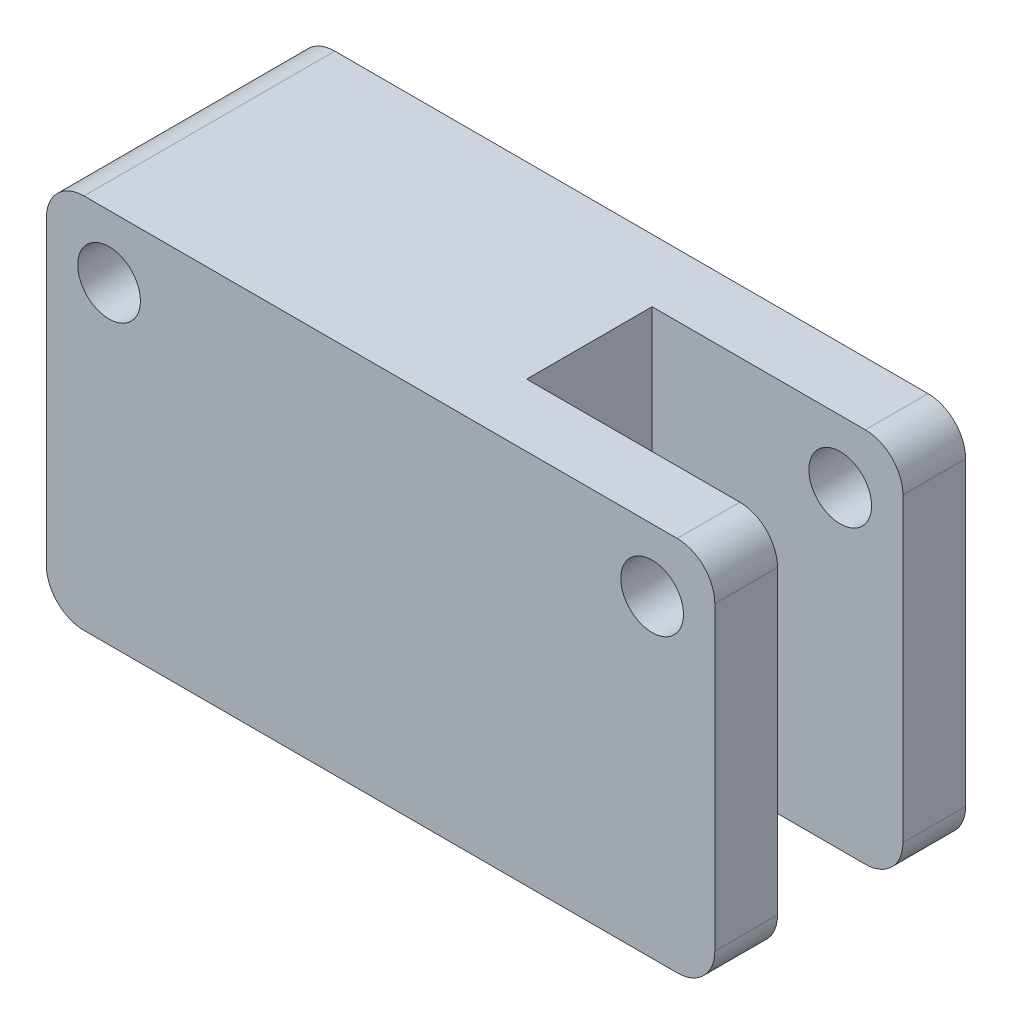
ISO-10303-21;
HEADER;
FILE_DESCRIPTION(('STEP AP214'),'2;1');
FILE_NAME('part.step','',(''),(''),'','','');
FILE_SCHEMA(('AUTOMOTIVE_DESIGN { 1 0 10303 214 1 1 1 1 }'));
ENDSEC;
DATA;
#1=APPLICATION_CONTEXT('core data for automotive mechanical design processes');
#2=APPLICATION_PROTOCOL_DEFINITION('international standard','automotive_design',2000,#1);
#3=PRODUCT_CONTEXT('',#1,'mechanical');
#4=PRODUCT('Part','Part','',(#3));
#5=PRODUCT_RELATED_PRODUCT_CATEGORY('part','',(#4));
#6=PRODUCT_DEFINITION_FORMATION('','',#4);
#7=PRODUCT_DEFINITION_CONTEXT('part definition',#1,'design');
#8=PRODUCT_DEFINITION('design','',#6,#7);
#9=PRODUCT_DEFINITION_SHAPE('','',#8);
#10=(LENGTH_UNIT() NAMED_UNIT(*) SI_UNIT(.MILLI.,.METRE.));
#11=(NAMED_UNIT(*) PLANE_ANGLE_UNIT() SI_UNIT($,.RADIAN.));
#12=(NAMED_UNIT(*) SI_UNIT($,.STERADIAN.) SOLID_ANGLE_UNIT());
#13=UNCERTAINTY_MEASURE_WITH_UNIT(LENGTH_MEASURE(1.E-05),#10,'distance_accuracy_value','');
#14=(GEOMETRIC_REPRESENTATION_CONTEXT(3) GLOBAL_UNCERTAINTY_ASSIGNED_CONTEXT((#13)) GLOBAL_UNIT_ASSIGNED_CONTEXT((#10,
#11,#12)) REPRESENTATION_CONTEXT('',''));
#15=CARTESIAN_POINT('',(0.,0.,0.));
#16=DIRECTION('',(0.,0.,1.));
#17=DIRECTION('',(1.,0.,0.));
#18=AXIS2_PLACEMENT_3D('',#15,#16,#17);
#19=CARTESIAN_POINT('',(53.3,15.,10.));
#20=DIRECTION('',(-1.,0.,0.));
#21=DIRECTION('',(0.,0.,1.));
#22=AXIS2_PLACEMENT_3D('',#19,#20,#21);
#23=PLANE('',#22);
#24=DIRECTION('',(0.,0.,-1.));
#25=VECTOR('',#24,1.);
#26=CARTESIAN_POINT('',(53.3,12.,10.));
#27=LINE('',#26,#25);
#28=CARTESIAN_POINT('',(53.3,12.,-10.));
#29=VERTEX_POINT('',#28);
#30=CARTESIAN_POINT('',(53.3,12.,-5.));
#31=VERTEX_POINT('',#30);
#32=EDGE_CURVE('E226',#29,#31,#27,.F.);
#33=ORIENTED_EDGE('',*,*,#32,.T.);
#34=DIRECTION('',(0.,1.,0.));
#35=VECTOR('',#34,1.);
#36=CARTESIAN_POINT('',(53.3,-15.,-5.));
#37=LINE('',#36,#35);
#38=CARTESIAN_POINT('',(53.3,-12.,-5.));
#39=VERTEX_POINT('',#38);
#40=EDGE_CURVE('E174',#39,#31,#37,.T.);
#41=ORIENTED_EDGE('',*,*,#40,.F.);
#42=DIRECTION('',(0.,0.,-1.));
#43=VECTOR('',#42,1.);
#44=CARTESIAN_POINT('',(53.3,-12.,-10.));
#45=LINE('',#44,#43);
#46=CARTESIAN_POINT('',(53.3,-12.,-10.));
#47=VERTEX_POINT('',#46);
#48=EDGE_CURVE('E221',#39,#47,#45,.T.);
#49=ORIENTED_EDGE('',*,*,#48,.T.);
#50=DIRECTION('',(0.,-1.,0.));
#51=VECTOR('',#50,1.);
#52=CARTESIAN_POINT('',(53.3,15.,-10.));
#53=LINE('',#52,#51);
#54=EDGE_CURVE('E197',#29,#47,#53,.T.);
#55=ORIENTED_EDGE('',*,*,#54,.F.);
#56=EDGE_LOOP('',(#33,#41,#49,#55));
#57=FACE_BOUND('',#56,.T.);
#58=ADVANCED_FACE('F36',(#57),#23,.F.);
#59=CARTESIAN_POINT('',(50.3,12.,0.));
#60=DIRECTION('',(0.,0.,-1.));
#61=DIRECTION('',(-1.,0.,0.));
#62=AXIS2_PLACEMENT_3D('',#59,#60,#61);
#63=CYLINDRICAL_SURFACE('',#62,3.);
#64=CARTESIAN_POINT('',(50.3,12.,-5.));
#65=DIRECTION('',(0.,0.,-1.));
#66=DIRECTION('',(-1.,0.,0.));
#67=AXIS2_PLACEMENT_3D('',#64,#65,#66);
#68=CIRCLE('',#67,3.);
#69=CARTESIAN_POINT('',(50.3,15.,-5.));
#70=VERTEX_POINT('',#69);
#71=EDGE_CURVE('E180',#31,#70,#68,.F.);
#72=ORIENTED_EDGE('',*,*,#71,.F.);
#73=ORIENTED_EDGE('',*,*,#32,.F.);
#74=CARTESIAN_POINT('',(50.3,12.,-10.));
#75=DIRECTION('',(0.,0.,1.));
#76=DIRECTION('',(1.,0.,0.));
#77=AXIS2_PLACEMENT_3D('',#74,#75,#76);
#78=CIRCLE('',#77,3.);
#79=CARTESIAN_POINT('',(50.3,15.,-10.));
#80=VERTEX_POINT('',#79);
#81=EDGE_CURVE('E219',#80,#29,#78,.F.);
#82=ORIENTED_EDGE('',*,*,#81,.F.);
#83=DIRECTION('',(0.,0.,-1.));
#84=VECTOR('',#83,1.);
#85=CARTESIAN_POINT('',(50.3,15.,0.));
#86=LINE('',#85,#84);
#87=EDGE_CURVE('E209',#70,#80,#86,.T.);
#88=ORIENTED_EDGE('',*,*,#87,.F.);
#89=EDGE_LOOP('',(#72,#73,#82,#88));
#90=FACE_BOUND('',#89,.T.);
#91=ADVANCED_FACE('F290',(#90),#63,.T.);
#92=CARTESIAN_POINT('',(50.3,-12.,10.));
#93=DIRECTION('',(0.,0.,1.));
#94=DIRECTION('',(1.,0.,0.));
#95=AXIS2_PLACEMENT_3D('',#92,#93,#94);
#96=CYLINDRICAL_SURFACE('',#95,3.);
#97=CARTESIAN_POINT('',(50.3,-12.,-5.));
#98=DIRECTION('',(0.,0.,-1.));
#99=DIRECTION('',(-1.,0.,0.));
#100=AXIS2_PLACEMENT_3D('',#97,#98,#99);
#101=CIRCLE('',#100,3.);
#102=CARTESIAN_POINT('',(50.3,-15.,-5.));
#103=VERTEX_POINT('',#102);
#104=EDGE_CURVE('E11',#103,#39,#101,.F.);
#105=ORIENTED_EDGE('',*,*,#104,.F.);
#106=DIRECTION('',(0.,0.,-1.));
#107=VECTOR('',#106,1.);
#108=CARTESIAN_POINT('',(50.3,-15.,10.));
#109=LINE('',#108,#107);
#110=CARTESIAN_POINT('',(50.3,-15.,-10.));
#111=VERTEX_POINT('',#110);
#112=EDGE_CURVE('E162',#111,#103,#109,.F.);
#113=ORIENTED_EDGE('',*,*,#112,.F.);
#114=CARTESIAN_POINT('',(50.3,-12.,-10.));
#115=DIRECTION('',(0.,0.,1.));
#116=DIRECTION('',(1.,0.,0.));
#117=AXIS2_PLACEMENT_3D('',#114,#115,#116);
#118=CIRCLE('',#117,3.);
#119=EDGE_CURVE('E217',#47,#111,#118,.F.);
#120=ORIENTED_EDGE('',*,*,#119,.F.);
#121=ORIENTED_EDGE('',*,*,#48,.F.);
#122=EDGE_LOOP('',(#105,#113,#120,#121));
#123=FACE_BOUND('',#122,.T.);
#124=ADVANCED_FACE('F281',(#123),#96,.T.);
#125=CARTESIAN_POINT('',(0.,15.,10.));
#126=DIRECTION('',(1.,0.,0.));
#127=DIRECTION('',(0.,0.,-1.));
#128=AXIS2_PLACEMENT_3D('',#125,#126,#127);
#129=PLANE('',#128);
#130=DIRECTION('',(0.,-1.,0.));
#131=VECTOR('',#130,1.);
#132=CARTESIAN_POINT('',(0.,15.,-10.));
#133=LINE('',#132,#131);
#134=CARTESIAN_POINT('',(0.,12.,-10.));
#135=VERTEX_POINT('',#134);
#136=CARTESIAN_POINT('',(0.,-12.,-10.));
#137=VERTEX_POINT('',#136);
#138=EDGE_CURVE('E190',#135,#137,#133,.T.);
#139=ORIENTED_EDGE('',*,*,#138,.T.);
#140=DIRECTION('',(0.,0.,1.));
#141=VECTOR('',#140,1.);
#142=CARTESIAN_POINT('',(0.,-12.,10.));
#143=LINE('',#142,#141);
#144=CARTESIAN_POINT('',(0.,-12.,10.));
#145=VERTEX_POINT('',#144);
#146=EDGE_CURVE('E242',#137,#145,#143,.T.);
#147=ORIENTED_EDGE('',*,*,#146,.T.);
#148=DIRECTION('',(0.,-1.,0.));
#149=VECTOR('',#148,1.);
#150=CARTESIAN_POINT('',(0.,15.,10.));
#151=LINE('',#150,#149);
#152=CARTESIAN_POINT('',(0.,12.,10.));
#153=VERTEX_POINT('',#152);
#154=EDGE_CURVE('E203',#153,#145,#151,.T.);
#155=ORIENTED_EDGE('',*,*,#154,.F.);
#156=DIRECTION('',(0.,0.,1.));
#157=VECTOR('',#156,1.);
#158=CARTESIAN_POINT('',(0.,12.,10.));
#159=LINE('',#158,#157);
#160=EDGE_CURVE('E240',#153,#135,#159,.F.);
#161=ORIENTED_EDGE('',*,*,#160,.T.);
#162=EDGE_LOOP('',(#139,#147,#155,#161));
#163=FACE_BOUND('',#162,.T.);
#164=ADVANCED_FACE('F273',(#163),#129,.F.);
#165=CARTESIAN_POINT('',(0.,15.,10.));
#166=DIRECTION('',(0.,0.,-1.));
#167=DIRECTION('',(-1.,0.,0.));
#168=AXIS2_PLACEMENT_3D('',#165,#166,#167);
#169=PLANE('',#168);
#170=CARTESIAN_POINT('',(48.3,10.,10.));
#171=DIRECTION('',(0.,0.,-1.));
#172=DIRECTION('',(-1.,0.,0.));
#173=AXIS2_PLACEMENT_3D('',#170,#171,#172);
#174=CIRCLE('',#173,2.49999999999999);
#175=CARTESIAN_POINT('',(45.8,10.,10.));
#176=VERTEX_POINT('',#175);
#177=EDGE_CURVE('E415',#176,#176,#174,.T.);
#178=ORIENTED_EDGE('',*,*,#177,.T.);
#179=EDGE_LOOP('',(#178));
#180=FACE_BOUND('',#179,.T.);
#181=CARTESIAN_POINT('',(5.,10.,10.));
#182=DIRECTION('',(0.,0.,-1.));
#183=DIRECTION('',(1.,0.,0.));
#184=AXIS2_PLACEMENT_3D('',#181,#182,#183);
#185=CIRCLE('',#184,2.5);
#186=CARTESIAN_POINT('',(7.5,10.,10.));
#187=VERTEX_POINT('',#186);
#188=EDGE_CURVE('E422',#187,#187,#185,.T.);
#189=ORIENTED_EDGE('',*,*,#188,.T.);
#190=EDGE_LOOP('',(#189));
#191=FACE_BOUND('',#190,.T.);
#192=DIRECTION('',(0.,-1.,0.));
#193=VECTOR('',#192,1.);
#194=CARTESIAN_POINT('',(53.3,15.,10.));
#195=LINE('',#194,#193);
#196=CARTESIAN_POINT('',(53.3,12.,10.));
#197=VERTEX_POINT('',#196);
#198=CARTESIAN_POINT('',(53.3,-12.,10.));
#199=VERTEX_POINT('',#198);
#200=EDGE_CURVE('E200',#197,#199,#195,.T.);
#201=ORIENTED_EDGE('',*,*,#200,.F.);
#202=CARTESIAN_POINT('',(50.3,12.,10.));
#203=DIRECTION('',(0.,0.,-1.));
#204=DIRECTION('',(-1.,0.,0.));
#205=AXIS2_PLACEMENT_3D('',#202,#203,#204);
#206=CIRCLE('',#205,3.);
#207=CARTESIAN_POINT('',(50.3,15.,10.));
#208=VERTEX_POINT('',#207);
#209=EDGE_CURVE('E234',#197,#208,#206,.F.);
#210=ORIENTED_EDGE('',*,*,#209,.T.);
#211=DIRECTION('',(1.,0.,0.));
#212=VECTOR('',#211,1.);
#213=CARTESIAN_POINT('',(0.,15.,10.));
#214=LINE('',#213,#212);
#215=CARTESIAN_POINT('',(3.,15.,10.));
#216=VERTEX_POINT('',#215);
#217=EDGE_CURVE('E183',#216,#208,#214,.T.);
#218=ORIENTED_EDGE('',*,*,#217,.F.);
#219=CARTESIAN_POINT('',(3.,12.,10.));
#220=DIRECTION('',(0.,0.,-1.));
#221=DIRECTION('',(-1.,0.,0.));
#222=AXIS2_PLACEMENT_3D('',#219,#220,#221);
#223=CIRCLE('',#222,3.);
#224=EDGE_CURVE('E229',#216,#153,#223,.F.);
#225=ORIENTED_EDGE('',*,*,#224,.T.);
#226=ORIENTED_EDGE('',*,*,#154,.T.);
#227=CARTESIAN_POINT('',(3.,-12.,10.));
#228=DIRECTION('',(0.,0.,-1.));
#229=DIRECTION('',(-1.,0.,0.));
#230=AXIS2_PLACEMENT_3D('',#227,#228,#229);
#231=CIRCLE('',#230,3.);
#232=CARTESIAN_POINT('',(3.,-15.,10.));
#233=VERTEX_POINT('',#232);
#234=EDGE_CURVE('E60',#145,#233,#231,.F.);
#235=ORIENTED_EDGE('',*,*,#234,.T.);
#236=DIRECTION('',(1.,0.,0.));
#237=VECTOR('',#236,1.);
#238=CARTESIAN_POINT('',(0.,-15.,10.));
#239=LINE('',#238,#237);
#240=CARTESIAN_POINT('',(50.3,-15.,10.));
#241=VERTEX_POINT('',#240);
#242=EDGE_CURVE('E182',#233,#241,#239,.T.);
#243=ORIENTED_EDGE('',*,*,#242,.T.);
#244=CARTESIAN_POINT('',(50.3,-12.,10.));
#245=DIRECTION('',(0.,0.,-1.));
#246=DIRECTION('',(-1.,0.,0.));
#247=AXIS2_PLACEMENT_3D('',#244,#245,#246);
#248=CIRCLE('',#247,3.);
#249=EDGE_CURVE('E232',#241,#199,#248,.F.);
#250=ORIENTED_EDGE('',*,*,#249,.T.);
#251=EDGE_LOOP('',(#201,#210,#218,#225,#226,#235,#243,#250));
#252=FACE_BOUND('',#251,.T.);
#253=ADVANCED_FACE('F253',(#180,#191,#252),#169,.F.);
#254=CARTESIAN_POINT('',(53.3,-12.,5.));
#255=VERTEX_POINT('',#254);
#256=EDGE_CURVE('E222',#199,#255,#45,.T.);
#257=ORIENTED_EDGE('',*,*,#256,.T.);
#258=DIRECTION('',(0.,1.,0.));
#259=VECTOR('',#258,1.);
#260=CARTESIAN_POINT('',(53.3,-15.,5.));
#261=LINE('',#260,#259);
#262=CARTESIAN_POINT('',(53.3,12.,5.));
#263=VERTEX_POINT('',#262);
#264=EDGE_CURVE('E52',#255,#263,#261,.T.);
#265=ORIENTED_EDGE('',*,*,#264,.T.);
#266=EDGE_CURVE('E225',#263,#197,#27,.F.);
#267=ORIENTED_EDGE('',*,*,#266,.T.);
#268=ORIENTED_EDGE('',*,*,#200,.T.);
#269=EDGE_LOOP('',(#257,#265,#267,#268));
#270=FACE_BOUND('',#269,.T.);
#271=ADVANCED_FACE('F256',(#270),#23,.F.);
#272=CARTESIAN_POINT('',(0.,15.,-10.));
#273=DIRECTION('',(0.,0.,1.));
#274=DIRECTION('',(1.,0.,0.));
#275=AXIS2_PLACEMENT_3D('',#272,#273,#274);
#276=PLANE('',#275);
#277=CARTESIAN_POINT('',(48.3,10.,-10.));
#278=DIRECTION('',(0.,0.,-1.));
#279=DIRECTION('',(-1.,0.,0.));
#280=AXIS2_PLACEMENT_3D('',#277,#278,#279);
#281=CIRCLE('',#280,2.49999999999999);
#282=CARTESIAN_POINT('',(45.8,10.,-10.));
#283=VERTEX_POINT('',#282);
#284=EDGE_CURVE('E418',#283,#283,#281,.T.);
#285=ORIENTED_EDGE('',*,*,#284,.F.);
#286=EDGE_LOOP('',(#285));
#287=FACE_BOUND('',#286,.T.);
#288=CARTESIAN_POINT('',(5.,10.,-10.));
#289=DIRECTION('',(0.,0.,-1.));
#290=DIRECTION('',(1.,0.,0.));
#291=AXIS2_PLACEMENT_3D('',#288,#289,#290);
#292=CIRCLE('',#291,2.5);
#293=CARTESIAN_POINT('',(7.5,10.,-10.));
#294=VERTEX_POINT('',#293);
#295=EDGE_CURVE('E426',#294,#294,#292,.T.);
#296=ORIENTED_EDGE('',*,*,#295,.F.);
#297=EDGE_LOOP('',(#296));
#298=FACE_BOUND('',#297,.T.);
#299=DIRECTION('',(-1.,0.,0.));
#300=VECTOR('',#299,1.);
#301=CARTESIAN_POINT('',(0.,15.,-10.));
#302=LINE('',#301,#300);
#303=CARTESIAN_POINT('',(3.,15.,-10.));
#304=VERTEX_POINT('',#303);
#305=EDGE_CURVE('E186',#80,#304,#302,.T.);
#306=ORIENTED_EDGE('',*,*,#305,.F.);
#307=ORIENTED_EDGE('',*,*,#81,.T.);
#308=ORIENTED_EDGE('',*,*,#54,.T.);
#309=ORIENTED_EDGE('',*,*,#119,.T.);
#310=DIRECTION('',(-1.,0.,0.));
#311=VECTOR('',#310,1.);
#312=CARTESIAN_POINT('',(0.,-15.,-10.));
#313=LINE('',#312,#311);
#314=CARTESIAN_POINT('',(3.,-15.,-10.));
#315=VERTEX_POINT('',#314);
#316=EDGE_CURVE('E187',#111,#315,#313,.T.);
#317=ORIENTED_EDGE('',*,*,#316,.T.);
#318=CARTESIAN_POINT('',(3.,-12.,-10.));
#319=DIRECTION('',(0.,0.,1.));
#320=DIRECTION('',(1.,0.,0.));
#321=AXIS2_PLACEMENT_3D('',#318,#319,#320);
#322=CIRCLE('',#321,3.);
#323=EDGE_CURVE('E215',#315,#137,#322,.F.);
#324=ORIENTED_EDGE('',*,*,#323,.T.);
#325=ORIENTED_EDGE('',*,*,#138,.F.);
#326=CARTESIAN_POINT('',(3.,12.,-10.));
#327=DIRECTION('',(0.,0.,1.));
#328=DIRECTION('',(1.,0.,0.));
#329=AXIS2_PLACEMENT_3D('',#326,#327,#328);
#330=CIRCLE('',#329,3.);
#331=EDGE_CURVE('E213',#135,#304,#330,.F.);
#332=ORIENTED_EDGE('',*,*,#331,.T.);
#333=EDGE_LOOP('',(#306,#307,#308,#309,#317,#324,#325,#332));
#334=FACE_BOUND('',#333,.T.);
#335=ADVANCED_FACE('F278',(#287,#298,#334),#276,.F.);
#336=CARTESIAN_POINT('',(0.,15.,0.));
#337=DIRECTION('',(0.,-1.,0.));
#338=DIRECTION('',(0.,0.,-1.));
#339=AXIS2_PLACEMENT_3D('',#336,#337,#338);
#340=PLANE('',#339);
#341=DIRECTION('',(0.,0.,1.));
#342=VECTOR('',#341,1.);
#343=CARTESIAN_POINT('',(33.3,15.,5.));
#344=LINE('',#343,#342);
#345=CARTESIAN_POINT('',(33.3,15.,-5.));
#346=VERTEX_POINT('',#345);
#347=CARTESIAN_POINT('',(33.3,15.,5.));
#348=VERTEX_POINT('',#347);
#349=EDGE_CURVE('E165',#346,#348,#344,.T.);
#350=ORIENTED_EDGE('',*,*,#349,.F.);
#351=DIRECTION('',(-1.,0.,0.));
#352=VECTOR('',#351,1.);
#353=CARTESIAN_POINT('',(33.3,15.,-5.));
#354=LINE('',#353,#352);
#355=EDGE_CURVE('E144',#70,#346,#354,.T.);
#356=ORIENTED_EDGE('',*,*,#355,.F.);
#357=ORIENTED_EDGE('',*,*,#87,.T.);
#358=ORIENTED_EDGE('',*,*,#305,.T.);
#359=DIRECTION('',(0.,0.,1.));
#360=VECTOR('',#359,1.);
#361=CARTESIAN_POINT('',(3.,15.,0.));
#362=LINE('',#361,#360);
#363=EDGE_CURVE('E206',#304,#216,#362,.T.);
#364=ORIENTED_EDGE('',*,*,#363,.T.);
#365=ORIENTED_EDGE('',*,*,#217,.T.);
#366=CARTESIAN_POINT('',(50.3,15.,5.));
#367=VERTEX_POINT('',#366);
#368=EDGE_CURVE('E210',#208,#367,#86,.T.);
#369=ORIENTED_EDGE('',*,*,#368,.T.);
#370=DIRECTION('',(1.,0.,0.));
#371=VECTOR('',#370,1.);
#372=CARTESIAN_POINT('',(53.3,15.,5.));
#373=LINE('',#372,#371);
#374=EDGE_CURVE('E163',#348,#367,#373,.T.);
#375=ORIENTED_EDGE('',*,*,#374,.F.);
#376=EDGE_LOOP('',(#350,#356,#357,#358,#364,#365,#369,#375));
#377=FACE_BOUND('',#376,.T.);
#378=ADVANCED_FACE('F264',(#377),#340,.F.);
#379=CARTESIAN_POINT('',(0.,-15.,0.));
#380=DIRECTION('',(0.,-1.,0.));
#381=DIRECTION('',(0.,0.,-1.));
#382=AXIS2_PLACEMENT_3D('',#379,#380,#381);
#383=PLANE('',#382);
#384=DIRECTION('',(-1.,0.,0.));
#385=VECTOR('',#384,1.);
#386=CARTESIAN_POINT('',(33.3,-15.,-5.));
#387=LINE('',#386,#385);
#388=CARTESIAN_POINT('',(33.3,-15.,-5.));
#389=VERTEX_POINT('',#388);
#390=EDGE_CURVE('E141',#103,#389,#387,.T.);
#391=ORIENTED_EDGE('',*,*,#390,.T.);
#392=DIRECTION('',(0.,0.,1.));
#393=VECTOR('',#392,1.);
#394=CARTESIAN_POINT('',(33.3,-15.,5.));
#395=LINE('',#394,#393);
#396=CARTESIAN_POINT('',(33.3,-15.,5.));
#397=VERTEX_POINT('',#396);
#398=EDGE_CURVE('E152',#389,#397,#395,.T.);
#399=ORIENTED_EDGE('',*,*,#398,.T.);
#400=DIRECTION('',(1.,0.,0.));
#401=VECTOR('',#400,1.);
#402=CARTESIAN_POINT('',(53.3,-15.,5.));
#403=LINE('',#402,#401);
#404=CARTESIAN_POINT('',(50.3,-15.,5.));
#405=VERTEX_POINT('',#404);
#406=EDGE_CURVE('E149',#397,#405,#403,.T.);
#407=ORIENTED_EDGE('',*,*,#406,.T.);
#408=EDGE_CURVE('E238',#405,#241,#109,.F.);
#409=ORIENTED_EDGE('',*,*,#408,.T.);
#410=ORIENTED_EDGE('',*,*,#242,.F.);
#411=DIRECTION('',(0.,0.,1.));
#412=VECTOR('',#411,1.);
#413=CARTESIAN_POINT('',(3.,-15.,-10.));
#414=LINE('',#413,#412);
#415=EDGE_CURVE('E236',#233,#315,#414,.F.);
#416=ORIENTED_EDGE('',*,*,#415,.T.);
#417=ORIENTED_EDGE('',*,*,#316,.F.);
#418=ORIENTED_EDGE('',*,*,#112,.T.);
#419=EDGE_LOOP('',(#391,#399,#407,#409,#410,#416,#417,#418));
#420=FACE_BOUND('',#419,.T.);
#421=ADVANCED_FACE('F159',(#420),#383,.T.);
#422=CARTESIAN_POINT('',(50.3,12.,5.));
#423=DIRECTION('',(0.,0.,1.));
#424=DIRECTION('',(1.,0.,0.));
#425=AXIS2_PLACEMENT_3D('',#422,#423,#424);
#426=CIRCLE('',#425,3.);
#427=EDGE_CURVE('E176',#367,#263,#426,.F.);
#428=ORIENTED_EDGE('',*,*,#427,.F.);
#429=ORIENTED_EDGE('',*,*,#368,.F.);
#430=ORIENTED_EDGE('',*,*,#209,.F.);
#431=ORIENTED_EDGE('',*,*,#266,.F.);
#432=EDGE_LOOP('',(#428,#429,#430,#431));
#433=FACE_BOUND('',#432,.T.);
#434=ADVANCED_FACE('F260',(#433),#63,.T.);
#435=CARTESIAN_POINT('',(50.3,-12.,5.));
#436=DIRECTION('',(0.,0.,1.));
#437=DIRECTION('',(1.,0.,0.));
#438=AXIS2_PLACEMENT_3D('',#435,#436,#437);
#439=CIRCLE('',#438,3.);
#440=EDGE_CURVE('E45',#255,#405,#439,.F.);
#441=ORIENTED_EDGE('',*,*,#440,.F.);
#442=ORIENTED_EDGE('',*,*,#256,.F.);
#443=ORIENTED_EDGE('',*,*,#249,.F.);
#444=ORIENTED_EDGE('',*,*,#408,.F.);
#445=EDGE_LOOP('',(#441,#442,#443,#444));
#446=FACE_BOUND('',#445,.T.);
#447=ADVANCED_FACE('F250',(#446),#96,.T.);
#448=CARTESIAN_POINT('',(3.,-12.,10.));
#449=DIRECTION('',(0.,0.,-1.));
#450=DIRECTION('',(-1.,0.,0.));
#451=AXIS2_PLACEMENT_3D('',#448,#449,#450);
#452=CYLINDRICAL_SURFACE('',#451,3.);
#453=ORIENTED_EDGE('',*,*,#323,.F.);
#454=ORIENTED_EDGE('',*,*,#415,.F.);
#455=ORIENTED_EDGE('',*,*,#234,.F.);
#456=ORIENTED_EDGE('',*,*,#146,.F.);
#457=EDGE_LOOP('',(#453,#454,#455,#456));
#458=FACE_BOUND('',#457,.T.);
#459=ADVANCED_FACE('F276',(#458),#452,.T.);
#460=CARTESIAN_POINT('',(3.,12.,0.));
#461=DIRECTION('',(0.,0.,1.));
#462=DIRECTION('',(1.,0.,0.));
#463=AXIS2_PLACEMENT_3D('',#460,#461,#462);
#464=CYLINDRICAL_SURFACE('',#463,3.);
#465=ORIENTED_EDGE('',*,*,#331,.F.);
#466=ORIENTED_EDGE('',*,*,#160,.F.);
#467=ORIENTED_EDGE('',*,*,#224,.F.);
#468=ORIENTED_EDGE('',*,*,#363,.F.);
#469=EDGE_LOOP('',(#465,#466,#467,#468));
#470=FACE_BOUND('',#469,.T.);
#471=ADVANCED_FACE('F38',(#470),#464,.T.);
#472=CARTESIAN_POINT('',(33.3,-15.,-5.));
#473=DIRECTION('',(0.,0.,-1.));
#474=DIRECTION('',(-1.,0.,0.));
#475=AXIS2_PLACEMENT_3D('',#472,#473,#474);
#476=PLANE('',#475);
#477=CARTESIAN_POINT('',(48.3,10.,-5.));
#478=DIRECTION('',(0.,0.,-1.));
#479=DIRECTION('',(-1.,0.,0.));
#480=AXIS2_PLACEMENT_3D('',#477,#478,#479);
#481=CIRCLE('',#480,2.49999999999999);
#482=CARTESIAN_POINT('',(45.8,10.,-5.));
#483=VERTEX_POINT('',#482);
#484=EDGE_CURVE('E168',#483,#483,#481,.T.);
#485=ORIENTED_EDGE('',*,*,#484,.T.);
#486=EDGE_LOOP('',(#485));
#487=FACE_BOUND('',#486,.T.);
#488=ORIENTED_EDGE('',*,*,#71,.T.);
#489=ORIENTED_EDGE('',*,*,#355,.T.);
#490=DIRECTION('',(0.,1.,0.));
#491=VECTOR('',#490,1.);
#492=CARTESIAN_POINT('',(33.3,-15.,-5.));
#493=LINE('',#492,#491);
#494=EDGE_CURVE('E137',#389,#346,#493,.T.);
#495=ORIENTED_EDGE('',*,*,#494,.F.);
#496=ORIENTED_EDGE('',*,*,#390,.F.);
#497=ORIENTED_EDGE('',*,*,#104,.T.);
#498=ORIENTED_EDGE('',*,*,#40,.T.);
#499=EDGE_LOOP('',(#488,#489,#495,#496,#497,#498));
#500=FACE_BOUND('',#499,.T.);
#501=ADVANCED_FACE('F139',(#487,#500),#476,.F.);
#502=CARTESIAN_POINT('',(53.3,-15.,5.));
#503=DIRECTION('',(0.,0.,1.));
#504=DIRECTION('',(1.,0.,0.));
#505=AXIS2_PLACEMENT_3D('',#502,#503,#504);
#506=PLANE('',#505);
#507=CARTESIAN_POINT('',(48.3,10.,5.));
#508=DIRECTION('',(0.,0.,1.));
#509=DIRECTION('',(1.,0.,0.));
#510=AXIS2_PLACEMENT_3D('',#507,#508,#509);
#511=CIRCLE('',#510,2.49999999999999);
#512=CARTESIAN_POINT('',(50.8,10.,5.));
#513=VERTEX_POINT('',#512);
#514=EDGE_CURVE('E40',#513,#513,#511,.T.);
#515=ORIENTED_EDGE('',*,*,#514,.T.);
#516=EDGE_LOOP('',(#515));
#517=FACE_BOUND('',#516,.T.);
#518=ORIENTED_EDGE('',*,*,#427,.T.);
#519=ORIENTED_EDGE('',*,*,#264,.F.);
#520=ORIENTED_EDGE('',*,*,#440,.T.);
#521=ORIENTED_EDGE('',*,*,#406,.F.);
#522=DIRECTION('',(0.,1.,0.));
#523=VECTOR('',#522,1.);
#524=CARTESIAN_POINT('',(33.3,-15.,5.));
#525=LINE('',#524,#523);
#526=EDGE_CURVE('E148',#397,#348,#525,.T.);
#527=ORIENTED_EDGE('',*,*,#526,.T.);
#528=ORIENTED_EDGE('',*,*,#374,.T.);
#529=EDGE_LOOP('',(#518,#519,#520,#521,#527,#528));
#530=FACE_BOUND('',#529,.T.);
#531=ADVANCED_FACE('F244',(#517,#530),#506,.F.);
#532=CARTESIAN_POINT('',(33.3,-15.,5.));
#533=DIRECTION('',(-1.,0.,0.));
#534=DIRECTION('',(0.,0.,1.));
#535=AXIS2_PLACEMENT_3D('',#532,#533,#534);
#536=PLANE('',#535);
#537=ORIENTED_EDGE('',*,*,#349,.T.);
#538=ORIENTED_EDGE('',*,*,#526,.F.);
#539=ORIENTED_EDGE('',*,*,#398,.F.);
#540=ORIENTED_EDGE('',*,*,#494,.T.);
#541=EDGE_LOOP('',(#537,#538,#539,#540));
#542=FACE_BOUND('',#541,.T.);
#543=ADVANCED_FACE('F153',(#542),#536,.F.);
#544=CARTESIAN_POINT('',(48.3,10.,10.));
#545=DIRECTION('',(0.,0.,-1.));
#546=DIRECTION('',(-1.,0.,0.));
#547=AXIS2_PLACEMENT_3D('',#544,#545,#546);
#548=CYLINDRICAL_SURFACE('',#547,2.49999999999999);
#549=ORIENTED_EDGE('',*,*,#177,.F.);
#550=EDGE_LOOP('',(#549));
#551=FACE_BOUND('',#550,.T.);
#552=ORIENTED_EDGE('',*,*,#514,.F.);
#553=EDGE_LOOP('',(#552));
#554=FACE_BOUND('',#553,.T.);
#555=ADVANCED_FACE('F366',(#551,#554),#548,.F.);
#556=ORIENTED_EDGE('',*,*,#284,.T.);
#557=EDGE_LOOP('',(#556));
#558=FACE_BOUND('',#557,.T.);
#559=ORIENTED_EDGE('',*,*,#484,.F.);
#560=EDGE_LOOP('',(#559));
#561=FACE_BOUND('',#560,.T.);
#562=ADVANCED_FACE('F381',(#558,#561),#548,.F.);
#563=CARTESIAN_POINT('',(5.,10.,10.));
#564=DIRECTION('',(0.,0.,-1.));
#565=DIRECTION('',(-1.,0.,0.));
#566=AXIS2_PLACEMENT_3D('',#563,#564,#565);
#567=CYLINDRICAL_SURFACE('',#566,2.5);
#568=ORIENTED_EDGE('',*,*,#188,.F.);
#569=EDGE_LOOP('',(#568));
#570=FACE_BOUND('',#569,.T.);
#571=ORIENTED_EDGE('',*,*,#295,.T.);
#572=EDGE_LOOP('',(#571));
#573=FACE_BOUND('',#572,.T.);
#574=ADVANCED_FACE('F388',(#570,#573),#567,.F.);
#575=CLOSED_SHELL('',(#58,#91,#124,#164,#253,#271,#335,#378,#421,#434,#447,#459,#471,#501,#531,
#543,#555,#562,#574));
#576=MANIFOLD_SOLID_BREP('B2',#575);
#577=ADVANCED_BREP_SHAPE_REPRESENTATION('',(#18,#576),#14);
#578=SHAPE_DEFINITION_REPRESENTATION(#9,#577);
ENDSEC;
END-ISO-10303-21;
